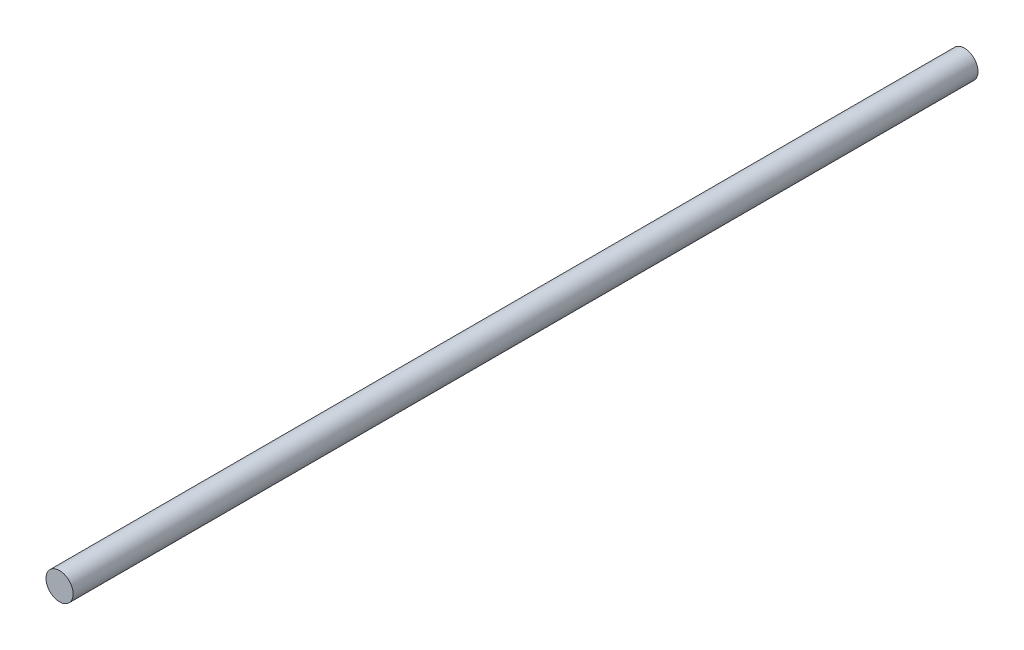
ISO-10303-21;
HEADER;
FILE_DESCRIPTION(('STEP AP214'),'2;1');
FILE_NAME('part.step','',(''),(''),'','','');
FILE_SCHEMA(('AUTOMOTIVE_DESIGN { 1 0 10303 214 1 1 1 1 }'));
ENDSEC;
DATA;
#1=APPLICATION_CONTEXT('core data for automotive mechanical design processes');
#2=APPLICATION_PROTOCOL_DEFINITION('international standard','automotive_design',2000,#1);
#3=PRODUCT_CONTEXT('',#1,'mechanical');
#4=PRODUCT('Part','Part','',(#3));
#5=PRODUCT_RELATED_PRODUCT_CATEGORY('part','',(#4));
#6=PRODUCT_DEFINITION_FORMATION('','',#4);
#7=PRODUCT_DEFINITION_CONTEXT('part definition',#1,'design');
#8=PRODUCT_DEFINITION('design','',#6,#7);
#9=PRODUCT_DEFINITION_SHAPE('','',#8);
#10=(LENGTH_UNIT() NAMED_UNIT(*) SI_UNIT(.MILLI.,.METRE.));
#11=(NAMED_UNIT(*) PLANE_ANGLE_UNIT() SI_UNIT($,.RADIAN.));
#12=(NAMED_UNIT(*) SI_UNIT($,.STERADIAN.) SOLID_ANGLE_UNIT());
#13=UNCERTAINTY_MEASURE_WITH_UNIT(LENGTH_MEASURE(1.E-05),#10,'distance_accuracy_value','');
#14=(GEOMETRIC_REPRESENTATION_CONTEXT(3) GLOBAL_UNCERTAINTY_ASSIGNED_CONTEXT((#13)) GLOBAL_UNIT_ASSIGNED_CONTEXT((#10,
#11,#12)) REPRESENTATION_CONTEXT('',''));
#15=CARTESIAN_POINT('',(0.,0.,0.));
#16=DIRECTION('',(0.,0.,1.));
#17=DIRECTION('',(1.,0.,0.));
#18=AXIS2_PLACEMENT_3D('',#15,#16,#17);
#19=CARTESIAN_POINT('',(0.,0.,50.8));
#20=DIRECTION('',(0.,0.,-1.));
#21=DIRECTION('',(-1.,0.,0.));
#22=AXIS2_PLACEMENT_3D('',#19,#20,#21);
#23=CYLINDRICAL_SURFACE('',#22,0.762);
#24=CARTESIAN_POINT('',(0.,0.,50.8));
#25=DIRECTION('',(0.,0.,1.));
#26=DIRECTION('',(1.,0.,0.));
#27=AXIS2_PLACEMENT_3D('',#24,#25,#26);
#28=CIRCLE('',#27,0.762);
#29=CARTESIAN_POINT('',(0.762,0.,50.8));
#30=VERTEX_POINT('',#29);
#31=EDGE_CURVE('E10',#30,#30,#28,.T.);
#32=ORIENTED_EDGE('',*,*,#31,.F.);
#33=EDGE_LOOP('',(#32));
#34=FACE_BOUND('',#33,.T.);
#35=CARTESIAN_POINT('',(0.,0.,0.));
#36=DIRECTION('',(0.,0.,1.));
#37=DIRECTION('',(1.,0.,0.));
#38=AXIS2_PLACEMENT_3D('',#35,#36,#37);
#39=CIRCLE('',#38,0.762);
#40=CARTESIAN_POINT('',(0.762,0.,0.));
#41=VERTEX_POINT('',#40);
#42=EDGE_CURVE('E33',#41,#41,#39,.T.);
#43=ORIENTED_EDGE('',*,*,#42,.T.);
#44=EDGE_LOOP('',(#43));
#45=FACE_BOUND('',#44,.T.);
#46=ADVANCED_FACE('F30',(#34,#45),#23,.T.);
#47=CARTESIAN_POINT('',(0.,0.,50.8));
#48=DIRECTION('',(0.,0.,1.));
#49=DIRECTION('',(1.,0.,0.));
#50=AXIS2_PLACEMENT_3D('',#47,#48,#49);
#51=PLANE('',#50);
#52=ORIENTED_EDGE('',*,*,#31,.T.);
#53=EDGE_LOOP('',(#52));
#54=FACE_BOUND('',#53,.T.);
#55=ADVANCED_FACE('F45',(#54),#51,.T.);
#56=CARTESIAN_POINT('',(0.,0.,0.));
#57=DIRECTION('',(0.,0.,1.));
#58=DIRECTION('',(1.,0.,0.));
#59=AXIS2_PLACEMENT_3D('',#56,#57,#58);
#60=PLANE('',#59);
#61=ORIENTED_EDGE('',*,*,#42,.F.);
#62=EDGE_LOOP('',(#61));
#63=FACE_BOUND('',#62,.T.);
#64=ADVANCED_FACE('F43',(#63),#60,.F.);
#65=CLOSED_SHELL('',(#46,#55,#64));
#66=MANIFOLD_SOLID_BREP('B2',#65);
#67=ADVANCED_BREP_SHAPE_REPRESENTATION('',(#18,#66),#14);
#68=SHAPE_DEFINITION_REPRESENTATION(#9,#67);
ENDSEC;
END-ISO-10303-21;
